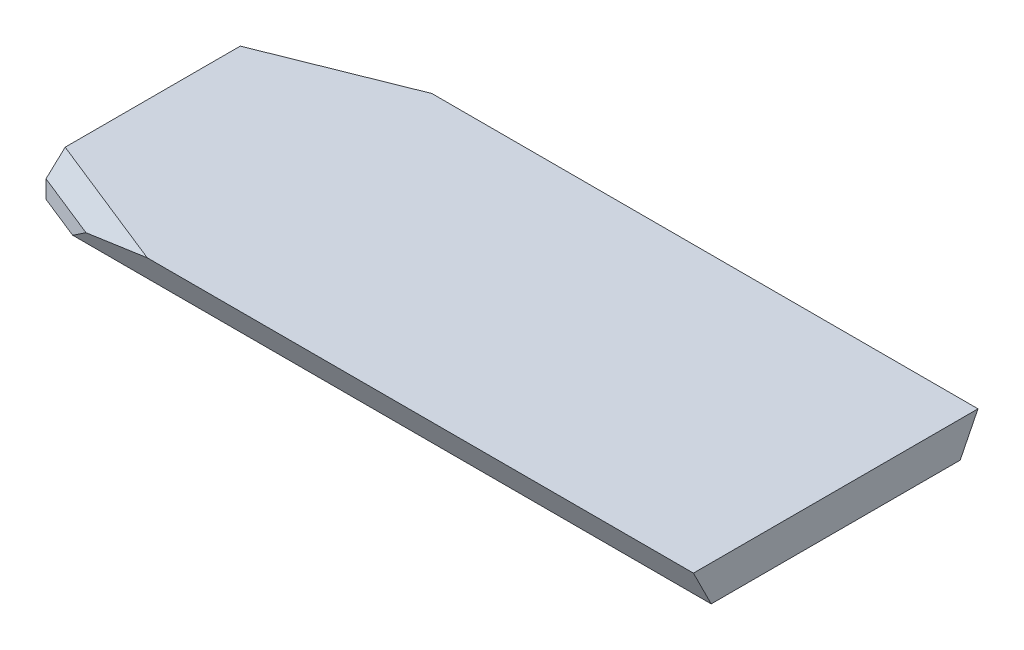
ISO-10303-21;
HEADER;
FILE_DESCRIPTION(('STEP AP214'),'2;1');
FILE_NAME('part.step','',(''),(''),'','','');
FILE_SCHEMA(('AUTOMOTIVE_DESIGN { 1 0 10303 214 1 1 1 1 }'));
ENDSEC;
DATA;
#1=APPLICATION_CONTEXT('core data for automotive mechanical design processes');
#2=APPLICATION_PROTOCOL_DEFINITION('international standard','automotive_design',2000,#1);
#3=PRODUCT_CONTEXT('',#1,'mechanical');
#4=PRODUCT('Part','Part','',(#3));
#5=PRODUCT_RELATED_PRODUCT_CATEGORY('part','',(#4));
#6=PRODUCT_DEFINITION_FORMATION('','',#4);
#7=PRODUCT_DEFINITION_CONTEXT('part definition',#1,'design');
#8=PRODUCT_DEFINITION('design','',#6,#7);
#9=PRODUCT_DEFINITION_SHAPE('','',#8);
#10=(LENGTH_UNIT() NAMED_UNIT(*) SI_UNIT(.MILLI.,.METRE.));
#11=(NAMED_UNIT(*) PLANE_ANGLE_UNIT() SI_UNIT($,.RADIAN.));
#12=(NAMED_UNIT(*) SI_UNIT($,.STERADIAN.) SOLID_ANGLE_UNIT());
#13=UNCERTAINTY_MEASURE_WITH_UNIT(LENGTH_MEASURE(1.E-05),#10,'distance_accuracy_value','');
#14=(GEOMETRIC_REPRESENTATION_CONTEXT(3) GLOBAL_UNCERTAINTY_ASSIGNED_CONTEXT((#13)) GLOBAL_UNIT_ASSIGNED_CONTEXT((#10,
#11,#12)) REPRESENTATION_CONTEXT('',''));
#15=CARTESIAN_POINT('',(0.,0.,0.));
#16=DIRECTION('',(0.,0.,1.));
#17=DIRECTION('',(1.,0.,0.));
#18=AXIS2_PLACEMENT_3D('',#15,#16,#17);
#19=CARTESIAN_POINT('',(96.,5.00000000000002,-20.));
#20=DIRECTION('',(0.,-1.,0.));
#21=DIRECTION('',(0.,0.,-1.));
#22=AXIS2_PLACEMENT_3D('',#19,#20,#21);
#23=PLANE('',#22);
#24=DIRECTION('',(0.,0.,1.));
#25=VECTOR('',#24,1.);
#26=CARTESIAN_POINT('',(0.,5.00000000000002,-20.));
#27=LINE('',#26,#25);
#28=CARTESIAN_POINT('',(0.,5.00000000000002,-12.3074175964327));
#29=VERTEX_POINT('',#28);
#30=CARTESIAN_POINT('',(0.,5.00000000000001,12.3074175964327));
#31=VERTEX_POINT('',#30);
#32=EDGE_CURVE('E170',#29,#31,#27,.T.);
#33=ORIENTED_EDGE('',*,*,#32,.T.);
#34=DIRECTION('',(0.928476690885259,0.,0.371390676354104));
#35=VECTOR('',#34,1.);
#36=CARTESIAN_POINT('',(71.618131863299,4.99999999999999,40.9546703417524));
#37=LINE('',#36,#35);
#38=CARTESIAN_POINT('',(19.2314560089181,5.,20.));
#39=VERTEX_POINT('',#38);
#40=EDGE_CURVE('E68',#31,#39,#37,.T.);
#41=ORIENTED_EDGE('',*,*,#40,.T.);
#42=DIRECTION('',(-1.,0.,0.));
#43=VECTOR('',#42,1.);
#44=CARTESIAN_POINT('',(96.,5.,20.));
#45=LINE('',#44,#43);
#46=CARTESIAN_POINT('',(96.,5.,20.));
#47=VERTEX_POINT('',#46);
#48=EDGE_CURVE('E211',#47,#39,#45,.T.);
#49=ORIENTED_EDGE('',*,*,#48,.F.);
#50=DIRECTION('',(0.,0.,1.));
#51=VECTOR('',#50,1.);
#52=CARTESIAN_POINT('',(96.,5.00000000000002,-20.));
#53=LINE('',#52,#51);
#54=CARTESIAN_POINT('',(96.,5.00000000000002,-20.));
#55=VERTEX_POINT('',#54);
#56=EDGE_CURVE('E180',#55,#47,#53,.T.);
#57=ORIENTED_EDGE('',*,*,#56,.F.);
#58=DIRECTION('',(-1.,0.,0.));
#59=VECTOR('',#58,1.);
#60=CARTESIAN_POINT('',(96.,5.00000000000002,-20.));
#61=LINE('',#60,#59);
#62=CARTESIAN_POINT('',(19.2314560089182,5.00000000000002,-20.));
#63=VERTEX_POINT('',#62);
#64=EDGE_CURVE('E194',#55,#63,#61,.T.);
#65=ORIENTED_EDGE('',*,*,#64,.T.);
#66=DIRECTION('',(-0.928476690885259,0.,0.371390676354104));
#67=VECTOR('',#66,1.);
#68=CARTESIAN_POINT('',(85.4112353115749,5.00000000000003,-46.4719117210627));
#69=LINE('',#68,#67);
#70=EDGE_CURVE('E224',#63,#29,#69,.T.);
#71=ORIENTED_EDGE('',*,*,#70,.T.);
#72=EDGE_LOOP('',(#33,#41,#49,#57,#65,#71));
#73=FACE_BOUND('',#72,.T.);
#74=ADVANCED_FACE('F45',(#73),#23,.F.);
#75=CARTESIAN_POINT('',(96.,5.,20.));
#76=DIRECTION('',(0.,0.447213595499955,-0.894427190999917));
#77=DIRECTION('',(0.,0.894427190999917,0.447213595499956));
#78=AXIS2_PLACEMENT_3D('',#75,#76,#77);
#79=PLANE('',#78);
#80=ORIENTED_EDGE('',*,*,#48,.T.);
#81=DIRECTION('',(0.962064686235976,0.244018916476038,0.122009458238018));
#82=VECTOR('',#81,1.);
#83=CARTESIAN_POINT('',(0.25761696594977,0.187459106548853,17.5937295532744));
#84=LINE('',#83,#82);
#85=CARTESIAN_POINT('',(9.37500000000004,2.50000000000002,18.75));
#86=VERTEX_POINT('',#85);
#87=EDGE_CURVE('E229',#39,#86,#84,.F.);
#88=ORIENTED_EDGE('',*,*,#87,.T.);
#89=DIRECTION('',(0.745355992499928,0.596284793999947,0.298142396999972));
#90=VECTOR('',#89,1.);
#91=CARTESIAN_POINT('',(2.22177777777781,-3.22257777777782,15.8887111111111));
#92=LINE('',#91,#90);
#93=CARTESIAN_POINT('',(6.25000000000015,0.,17.5));
#94=VERTEX_POINT('',#93);
#95=EDGE_CURVE('E158',#94,#86,#92,.T.);
#96=ORIENTED_EDGE('',*,*,#95,.F.);
#97=DIRECTION('',(-1.,0.,0.));
#98=VECTOR('',#97,1.);
#99=CARTESIAN_POINT('',(96.,0.,17.5));
#100=LINE('',#99,#98);
#101=CARTESIAN_POINT('',(96.,0.,17.5));
#102=VERTEX_POINT('',#101);
#103=EDGE_CURVE('E207',#102,#94,#100,.T.);
#104=ORIENTED_EDGE('',*,*,#103,.F.);
#105=DIRECTION('',(0.,-0.894427190999917,-0.447213595499956));
#106=VECTOR('',#105,1.);
#107=CARTESIAN_POINT('',(96.,5.,20.));
#108=LINE('',#107,#106);
#109=EDGE_CURVE('E184',#47,#102,#108,.T.);
#110=ORIENTED_EDGE('',*,*,#109,.F.);
#111=EDGE_LOOP('',(#80,#88,#96,#104,#110));
#112=FACE_BOUND('',#111,.T.);
#113=ADVANCED_FACE('F257',(#112),#79,.F.);
#114=CARTESIAN_POINT('',(96.,0.,17.5));
#115=DIRECTION('',(0.,1.,0.));
#116=DIRECTION('',(0.,0.,1.));
#117=AXIS2_PLACEMENT_3D('',#114,#115,#116);
#118=PLANE('',#117);
#119=CARTESIAN_POINT('',(23.,0.,9.));
#120=DIRECTION('',(0.,-1.,0.));
#121=DIRECTION('',(0.,0.,-1.));
#122=AXIS2_PLACEMENT_3D('',#119,#120,#121);
#123=CIRCLE('',#122,1.65);
#124=CARTESIAN_POINT('',(23.,0.,7.35));
#125=VERTEX_POINT('',#124);
#126=EDGE_CURVE('E129',#125,#125,#123,.T.);
#127=ORIENTED_EDGE('',*,*,#126,.F.);
#128=EDGE_LOOP('',(#127));
#129=FACE_BOUND('',#128,.T.);
#130=CARTESIAN_POINT('',(80.,0.,-9.));
#131=DIRECTION('',(0.,-1.,0.));
#132=DIRECTION('',(0.,0.,-1.));
#133=AXIS2_PLACEMENT_3D('',#130,#131,#132);
#134=CIRCLE('',#133,1.65);
#135=CARTESIAN_POINT('',(80.,0.,-10.65));
#136=VERTEX_POINT('',#135);
#137=EDGE_CURVE('E128',#136,#136,#134,.T.);
#138=ORIENTED_EDGE('',*,*,#137,.F.);
#139=EDGE_LOOP('',(#138));
#140=FACE_BOUND('',#139,.T.);
#141=CARTESIAN_POINT('',(23.,0.,-9.));
#142=DIRECTION('',(0.,-1.,0.));
#143=DIRECTION('',(0.,0.,-1.));
#144=AXIS2_PLACEMENT_3D('',#141,#142,#143);
#145=CIRCLE('',#144,2.);
#146=CARTESIAN_POINT('',(23.,0.,-11.));
#147=VERTEX_POINT('',#146);
#148=EDGE_CURVE('E142',#147,#147,#145,.T.);
#149=ORIENTED_EDGE('',*,*,#148,.F.);
#150=EDGE_LOOP('',(#149));
#151=FACE_BOUND('',#150,.T.);
#152=CARTESIAN_POINT('',(80.,0.,9.));
#153=DIRECTION('',(0.,-1.,0.));
#154=DIRECTION('',(0.,0.,-1.));
#155=AXIS2_PLACEMENT_3D('',#152,#153,#154);
#156=CIRCLE('',#155,2.);
#157=CARTESIAN_POINT('',(80.,0.,7.));
#158=VERTEX_POINT('',#157);
#159=EDGE_CURVE('E150',#158,#158,#156,.T.);
#160=ORIENTED_EDGE('',*,*,#159,.F.);
#161=EDGE_LOOP('',(#160));
#162=FACE_BOUND('',#161,.T.);
#163=DIRECTION('',(0.,0.,-1.));
#164=VECTOR('',#163,1.);
#165=CARTESIAN_POINT('',(0.,0.,17.5));
#166=LINE('',#165,#164);
#167=CARTESIAN_POINT('',(0.,0.,15.));
#168=VERTEX_POINT('',#167);
#169=CARTESIAN_POINT('',(0.,0.,-15.));
#170=VERTEX_POINT('',#169);
#171=EDGE_CURVE('E185',#168,#170,#166,.T.);
#172=ORIENTED_EDGE('',*,*,#171,.T.);
#173=DIRECTION('',(-0.928476690885259,0.,0.371390676354104));
#174=VECTOR('',#173,1.);
#175=CARTESIAN_POINT('',(0.,0.,-15.));
#176=LINE('',#175,#174);
#177=CARTESIAN_POINT('',(6.25000000000005,0.,-17.5));
#178=VERTEX_POINT('',#177);
#179=EDGE_CURVE('E162',#178,#170,#176,.T.);
#180=ORIENTED_EDGE('',*,*,#179,.F.);
#181=DIRECTION('',(-1.,0.,0.));
#182=VECTOR('',#181,1.);
#183=CARTESIAN_POINT('',(96.,0.,-17.5));
#184=LINE('',#183,#182);
#185=CARTESIAN_POINT('',(96.,0.,-17.5));
#186=VERTEX_POINT('',#185);
#187=EDGE_CURVE('E203',#186,#178,#184,.T.);
#188=ORIENTED_EDGE('',*,*,#187,.F.);
#189=DIRECTION('',(0.,0.,-1.));
#190=VECTOR('',#189,1.);
#191=CARTESIAN_POINT('',(96.,0.,17.5));
#192=LINE('',#191,#190);
#193=EDGE_CURVE('E188',#102,#186,#192,.T.);
#194=ORIENTED_EDGE('',*,*,#193,.F.);
#195=ORIENTED_EDGE('',*,*,#103,.T.);
#196=DIRECTION('',(0.928476690885259,0.,0.371390676354104));
#197=VECTOR('',#196,1.);
#198=CARTESIAN_POINT('',(0.,0.,15.));
#199=LINE('',#198,#197);
#200=EDGE_CURVE('E163',#168,#94,#199,.T.);
#201=ORIENTED_EDGE('',*,*,#200,.F.);
#202=EDGE_LOOP('',(#172,#180,#188,#194,#195,#201));
#203=FACE_BOUND('',#202,.T.);
#204=ADVANCED_FACE('F245',(#129,#140,#151,#162,#203),#118,.F.);
#205=CARTESIAN_POINT('',(96.,5.00000000000002,-20.));
#206=DIRECTION('',(0.,0.447213595499954,0.894427190999918));
#207=DIRECTION('',(0.,-0.894427190999918,0.447213595499954));
#208=AXIS2_PLACEMENT_3D('',#205,#206,#207);
#209=PLANE('',#208);
#210=DIRECTION('',(-0.745355992499928,-0.596284793999947,0.298142396999971));
#211=VECTOR('',#210,1.);
#212=CARTESIAN_POINT('',(2.22177777777781,-3.2225777777778,-15.8887111111111));
#213=LINE('',#212,#211);
#214=CARTESIAN_POINT('',(9.37500000000002,2.50000000000002,-18.75));
#215=VERTEX_POINT('',#214);
#216=EDGE_CURVE('E159',#215,#178,#213,.T.);
#217=ORIENTED_EDGE('',*,*,#216,.F.);
#218=DIRECTION('',(-0.962064686235975,-0.244018916476039,0.122009458238018));
#219=VECTOR('',#218,1.);
#220=CARTESIAN_POINT('',(0.257616965949774,0.187459106548848,-17.5937295532744));
#221=LINE('',#220,#219);
#222=EDGE_CURVE('E11',#215,#63,#221,.F.);
#223=ORIENTED_EDGE('',*,*,#222,.T.);
#224=ORIENTED_EDGE('',*,*,#64,.F.);
#225=DIRECTION('',(0.,0.894427190999918,-0.447213595499954));
#226=VECTOR('',#225,1.);
#227=CARTESIAN_POINT('',(96.,5.00000000000002,-20.));
#228=LINE('',#227,#226);
#229=EDGE_CURVE('E191',#186,#55,#228,.T.);
#230=ORIENTED_EDGE('',*,*,#229,.F.);
#231=ORIENTED_EDGE('',*,*,#187,.T.);
#232=EDGE_LOOP('',(#217,#223,#224,#230,#231));
#233=FACE_BOUND('',#232,.T.);
#234=ADVANCED_FACE('F239',(#233),#209,.F.);
#235=CARTESIAN_POINT('',(96.,0.,0.));
#236=DIRECTION('',(1.,0.,0.));
#237=DIRECTION('',(0.,0.,-1.));
#238=AXIS2_PLACEMENT_3D('',#235,#236,#237);
#239=PLANE('',#238);
#240=ORIENTED_EDGE('',*,*,#56,.T.);
#241=ORIENTED_EDGE('',*,*,#109,.T.);
#242=ORIENTED_EDGE('',*,*,#193,.T.);
#243=ORIENTED_EDGE('',*,*,#229,.T.);
#244=EDGE_LOOP('',(#240,#241,#242,#243));
#245=FACE_BOUND('',#244,.T.);
#246=ADVANCED_FACE('F253',(#245),#239,.T.);
#247=CARTESIAN_POINT('',(0.,0.,0.));
#248=DIRECTION('',(1.,0.,0.));
#249=DIRECTION('',(0.,0.,-1.));
#250=AXIS2_PLACEMENT_3D('',#247,#248,#249);
#251=PLANE('',#250);
#252=DIRECTION('',(0.,1.,0.));
#253=VECTOR('',#252,1.);
#254=CARTESIAN_POINT('',(0.,-0.00100000000002268,15.));
#255=LINE('',#254,#253);
#256=CARTESIAN_POINT('',(0.,2.50000000000002,15.));
#257=VERTEX_POINT('',#256);
#258=EDGE_CURVE('E174',#168,#257,#255,.T.);
#259=ORIENTED_EDGE('',*,*,#258,.T.);
#260=DIRECTION('',(0.,-0.680413817439769,0.732828108792943));
#261=VECTOR('',#260,1.);
#262=CARTESIAN_POINT('',(0.,2.50000000000002,15.));
#263=LINE('',#262,#261);
#264=EDGE_CURVE('E221',#257,#31,#263,.F.);
#265=ORIENTED_EDGE('',*,*,#264,.T.);
#266=ORIENTED_EDGE('',*,*,#32,.F.);
#267=DIRECTION('',(0.,0.680413817439771,0.732828108792941));
#268=VECTOR('',#267,1.);
#269=CARTESIAN_POINT('',(0.,2.50000000000001,-15.));
#270=LINE('',#269,#268);
#271=CARTESIAN_POINT('',(0.,2.50000000000001,-15.));
#272=VERTEX_POINT('',#271);
#273=EDGE_CURVE('E218',#29,#272,#270,.F.);
#274=ORIENTED_EDGE('',*,*,#273,.T.);
#275=DIRECTION('',(0.,1.,0.));
#276=VECTOR('',#275,1.);
#277=CARTESIAN_POINT('',(0.,-0.00100000000001054,-15.));
#278=LINE('',#277,#276);
#279=EDGE_CURVE('E166',#170,#272,#278,.T.);
#280=ORIENTED_EDGE('',*,*,#279,.F.);
#281=ORIENTED_EDGE('',*,*,#171,.F.);
#282=EDGE_LOOP('',(#259,#265,#266,#274,#280,#281));
#283=FACE_BOUND('',#282,.T.);
#284=ADVANCED_FACE('F249',(#283),#251,.F.);
#285=CARTESIAN_POINT('',(0.,-0.00100000000002268,15.));
#286=DIRECTION('',(0.371390676354104,0.,-0.928476690885259));
#287=DIRECTION('',(-0.928476690885259,0.,-0.371390676354104));
#288=AXIS2_PLACEMENT_3D('',#285,#286,#287);
#289=PLANE('',#288);
#290=ORIENTED_EDGE('',*,*,#95,.T.);
#291=DIRECTION('',(-0.928476690885259,0.,-0.371390676354104));
#292=VECTOR('',#291,1.);
#293=CARTESIAN_POINT('',(0.,2.50000000000002,15.));
#294=LINE('',#293,#292);
#295=EDGE_CURVE('E214',#86,#257,#294,.T.);
#296=ORIENTED_EDGE('',*,*,#295,.T.);
#297=ORIENTED_EDGE('',*,*,#258,.F.);
#298=ORIENTED_EDGE('',*,*,#200,.T.);
#299=EDGE_LOOP('',(#290,#296,#297,#298));
#300=FACE_BOUND('',#299,.T.);
#301=ADVANCED_FACE('F259',(#300),#289,.F.);
#302=CARTESIAN_POINT('',(0.,-0.00100000000001054,-15.));
#303=DIRECTION('',(0.371390676354104,0.,0.928476690885259));
#304=DIRECTION('',(0.928476690885259,0.,-0.371390676354104));
#305=AXIS2_PLACEMENT_3D('',#302,#303,#304);
#306=PLANE('',#305);
#307=ORIENTED_EDGE('',*,*,#279,.T.);
#308=DIRECTION('',(0.928476690885259,0.,-0.371390676354104));
#309=VECTOR('',#308,1.);
#310=CARTESIAN_POINT('',(0.,2.50000000000001,-15.));
#311=LINE('',#310,#309);
#312=EDGE_CURVE('E55',#272,#215,#311,.T.);
#313=ORIENTED_EDGE('',*,*,#312,.T.);
#314=ORIENTED_EDGE('',*,*,#216,.T.);
#315=ORIENTED_EDGE('',*,*,#179,.T.);
#316=EDGE_LOOP('',(#307,#313,#314,#315));
#317=FACE_BOUND('',#316,.T.);
#318=ADVANCED_FACE('F234',(#317),#306,.F.);
#319=CARTESIAN_POINT('',(0.,2.50000000000002,15.));
#320=DIRECTION('',(0.262612865719444,-0.70710678118655,-0.65653216429861));
#321=DIRECTION('',(-0.928476690885259,0.,-0.371390676354104));
#322=AXIS2_PLACEMENT_3D('',#319,#320,#321);
#323=PLANE('',#322);
#324=ORIENTED_EDGE('',*,*,#87,.F.);
#325=ORIENTED_EDGE('',*,*,#40,.F.);
#326=ORIENTED_EDGE('',*,*,#264,.F.);
#327=ORIENTED_EDGE('',*,*,#295,.F.);
#328=EDGE_LOOP('',(#324,#325,#326,#327));
#329=FACE_BOUND('',#328,.T.);
#330=ADVANCED_FACE('F263',(#329),#323,.F.);
#331=CARTESIAN_POINT('',(0.,2.50000000000001,-15.));
#332=DIRECTION('',(0.262612865719445,-0.707106781186549,0.656532164298612));
#333=DIRECTION('',(0.928476690885259,0.,-0.371390676354104));
#334=AXIS2_PLACEMENT_3D('',#331,#332,#333);
#335=PLANE('',#334);
#336=ORIENTED_EDGE('',*,*,#273,.F.);
#337=ORIENTED_EDGE('',*,*,#70,.F.);
#338=ORIENTED_EDGE('',*,*,#222,.F.);
#339=ORIENTED_EDGE('',*,*,#312,.F.);
#340=EDGE_LOOP('',(#336,#337,#338,#339));
#341=FACE_BOUND('',#340,.T.);
#342=ADVANCED_FACE('F48',(#341),#335,.F.);
#343=CARTESIAN_POINT('',(80.,4.,9.));
#344=DIRECTION('',(0.,1.,0.));
#345=DIRECTION('',(0.,0.,1.));
#346=AXIS2_PLACEMENT_3D('',#343,#344,#345);
#347=PLANE('',#346);
#348=CARTESIAN_POINT('',(80.,4.,9.));
#349=DIRECTION('',(0.,-1.,0.));
#350=DIRECTION('',(0.,0.,-1.));
#351=AXIS2_PLACEMENT_3D('',#348,#349,#350);
#352=CIRCLE('',#351,2.);
#353=CARTESIAN_POINT('',(80.,4.,7.));
#354=VERTEX_POINT('',#353);
#355=EDGE_CURVE('E154',#354,#354,#352,.T.);
#356=ORIENTED_EDGE('',*,*,#355,.T.);
#357=EDGE_LOOP('',(#356));
#358=FACE_BOUND('',#357,.T.);
#359=ADVANCED_FACE('F269',(#358),#347,.F.);
#360=CARTESIAN_POINT('',(80.,0.,9.));
#361=DIRECTION('',(0.,-1.,0.));
#362=DIRECTION('',(0.,0.,-1.));
#363=AXIS2_PLACEMENT_3D('',#360,#361,#362);
#364=CYLINDRICAL_SURFACE('',#363,2.);
#365=ORIENTED_EDGE('',*,*,#355,.F.);
#366=EDGE_LOOP('',(#365));
#367=FACE_BOUND('',#366,.T.);
#368=ORIENTED_EDGE('',*,*,#159,.T.);
#369=EDGE_LOOP('',(#368));
#370=FACE_BOUND('',#369,.T.);
#371=ADVANCED_FACE('F292',(#367,#370),#364,.F.);
#372=CARTESIAN_POINT('',(23.,4.,-9.));
#373=DIRECTION('',(0.,1.,0.));
#374=DIRECTION('',(0.,0.,1.));
#375=AXIS2_PLACEMENT_3D('',#372,#373,#374);
#376=PLANE('',#375);
#377=CARTESIAN_POINT('',(23.,4.,-9.));
#378=DIRECTION('',(0.,-1.,0.));
#379=DIRECTION('',(0.,0.,-1.));
#380=AXIS2_PLACEMENT_3D('',#377,#378,#379);
#381=CIRCLE('',#380,2.);
#382=CARTESIAN_POINT('',(23.,4.,-11.));
#383=VERTEX_POINT('',#382);
#384=EDGE_CURVE('E146',#383,#383,#381,.T.);
#385=ORIENTED_EDGE('',*,*,#384,.T.);
#386=EDGE_LOOP('',(#385));
#387=FACE_BOUND('',#386,.T.);
#388=ADVANCED_FACE('F296',(#387),#376,.F.);
#389=CARTESIAN_POINT('',(23.,0.,-9.));
#390=DIRECTION('',(0.,-1.,0.));
#391=DIRECTION('',(0.,0.,-1.));
#392=AXIS2_PLACEMENT_3D('',#389,#390,#391);
#393=CYLINDRICAL_SURFACE('',#392,2.);
#394=ORIENTED_EDGE('',*,*,#384,.F.);
#395=EDGE_LOOP('',(#394));
#396=FACE_BOUND('',#395,.T.);
#397=ORIENTED_EDGE('',*,*,#148,.T.);
#398=EDGE_LOOP('',(#397));
#399=FACE_BOUND('',#398,.T.);
#400=ADVANCED_FACE('F300',(#396,#399),#393,.F.);
#401=CARTESIAN_POINT('',(80.,4.,-9.));
#402=DIRECTION('',(0.,-1.,0.));
#403=DIRECTION('',(0.,0.,-1.));
#404=AXIS2_PLACEMENT_3D('',#401,#402,#403);
#405=CONICAL_SURFACE('',#404,1.65,1.02974425867665);
#406=CARTESIAN_POINT('',(80.,4.99142002139548,-9.));
#407=VERTEX_POINT('',#406);
#408=VERTEX_LOOP('',#407);
#409=FACE_BOUND('',#408,.T.);
#410=CARTESIAN_POINT('',(80.,4.,-9.));
#411=DIRECTION('',(0.,-1.,0.));
#412=DIRECTION('',(0.,0.,-1.));
#413=AXIS2_PLACEMENT_3D('',#410,#411,#412);
#414=CIRCLE('',#413,1.65);
#415=CARTESIAN_POINT('',(80.,4.,-10.65));
#416=VERTEX_POINT('',#415);
#417=EDGE_CURVE('E134',#416,#416,#414,.T.);
#418=ORIENTED_EDGE('',*,*,#417,.T.);
#419=EDGE_LOOP('',(#418));
#420=FACE_BOUND('',#419,.T.);
#421=ADVANCED_FACE('F304',(#409,#420),#405,.F.);
#422=CARTESIAN_POINT('',(80.,0.,-9.));
#423=DIRECTION('',(0.,-1.,0.));
#424=DIRECTION('',(0.,0.,-1.));
#425=AXIS2_PLACEMENT_3D('',#422,#423,#424);
#426=CYLINDRICAL_SURFACE('',#425,1.65);
#427=ORIENTED_EDGE('',*,*,#417,.F.);
#428=EDGE_LOOP('',(#427));
#429=FACE_BOUND('',#428,.T.);
#430=ORIENTED_EDGE('',*,*,#137,.T.);
#431=EDGE_LOOP('',(#430));
#432=FACE_BOUND('',#431,.T.);
#433=ADVANCED_FACE('F121',(#429,#432),#426,.F.);
#434=CARTESIAN_POINT('',(23.,4.,9.));
#435=DIRECTION('',(0.,-1.,0.));
#436=DIRECTION('',(0.,0.,-1.));
#437=AXIS2_PLACEMENT_3D('',#434,#435,#436);
#438=CONICAL_SURFACE('',#437,1.65,1.02974425867665);
#439=CARTESIAN_POINT('',(23.,4.99142002139547,9.));
#440=VERTEX_POINT('',#439);
#441=VERTEX_LOOP('',#440);
#442=FACE_BOUND('',#441,.T.);
#443=CARTESIAN_POINT('',(23.,4.,9.));
#444=DIRECTION('',(0.,-1.,0.));
#445=DIRECTION('',(0.,0.,-1.));
#446=AXIS2_PLACEMENT_3D('',#443,#444,#445);
#447=CIRCLE('',#446,1.65);
#448=CARTESIAN_POINT('',(23.,4.,7.35));
#449=VERTEX_POINT('',#448);
#450=EDGE_CURVE('E125',#449,#449,#447,.T.);
#451=ORIENTED_EDGE('',*,*,#450,.T.);
#452=EDGE_LOOP('',(#451));
#453=FACE_BOUND('',#452,.T.);
#454=ADVANCED_FACE('F117',(#442,#453),#438,.F.);
#455=CARTESIAN_POINT('',(23.,0.,9.));
#456=DIRECTION('',(0.,-1.,0.));
#457=DIRECTION('',(0.,0.,-1.));
#458=AXIS2_PLACEMENT_3D('',#455,#456,#457);
#459=CYLINDRICAL_SURFACE('',#458,1.65);
#460=ORIENTED_EDGE('',*,*,#450,.F.);
#461=EDGE_LOOP('',(#460));
#462=FACE_BOUND('',#461,.T.);
#463=ORIENTED_EDGE('',*,*,#126,.T.);
#464=EDGE_LOOP('',(#463));
#465=FACE_BOUND('',#464,.T.);
#466=ADVANCED_FACE('F120',(#462,#465),#459,.F.);
#467=CLOSED_SHELL('',(#74,#113,#204,#234,#246,#284,#301,#318,#330,#342,#359,#371,#388,#400,#421,
#433,#454,#466));
#468=MANIFOLD_SOLID_BREP('B2',#467);
#469=ADVANCED_BREP_SHAPE_REPRESENTATION('',(#18,#468),#14);
#470=SHAPE_DEFINITION_REPRESENTATION(#9,#469);
ENDSEC;
END-ISO-10303-21;
